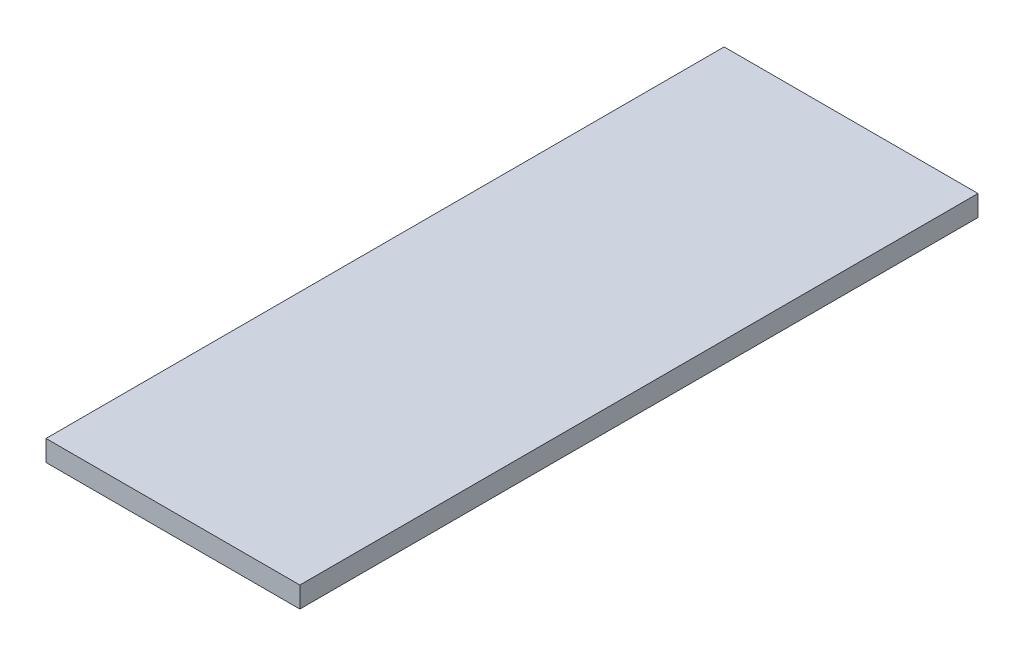
ISO-10303-21;
HEADER;
FILE_DESCRIPTION(('STEP AP214'),'2;1');
FILE_NAME('part.step','',(''),(''),'','','');
FILE_SCHEMA(('AUTOMOTIVE_DESIGN { 1 0 10303 214 1 1 1 1 }'));
ENDSEC;
DATA;
#1=APPLICATION_CONTEXT('core data for automotive mechanical design processes');
#2=APPLICATION_PROTOCOL_DEFINITION('international standard','automotive_design',2000,#1);
#3=PRODUCT_CONTEXT('',#1,'mechanical');
#4=PRODUCT('Part','Part','',(#3));
#5=PRODUCT_RELATED_PRODUCT_CATEGORY('part','',(#4));
#6=PRODUCT_DEFINITION_FORMATION('','',#4);
#7=PRODUCT_DEFINITION_CONTEXT('part definition',#1,'design');
#8=PRODUCT_DEFINITION('design','',#6,#7);
#9=PRODUCT_DEFINITION_SHAPE('','',#8);
#10=(LENGTH_UNIT() NAMED_UNIT(*) SI_UNIT(.MILLI.,.METRE.));
#11=(NAMED_UNIT(*) PLANE_ANGLE_UNIT() SI_UNIT($,.RADIAN.));
#12=(NAMED_UNIT(*) SI_UNIT($,.STERADIAN.) SOLID_ANGLE_UNIT());
#13=UNCERTAINTY_MEASURE_WITH_UNIT(LENGTH_MEASURE(1.E-05),#10,'distance_accuracy_value','');
#14=(GEOMETRIC_REPRESENTATION_CONTEXT(3) GLOBAL_UNCERTAINTY_ASSIGNED_CONTEXT((#13)) GLOBAL_UNIT_ASSIGNED_CONTEXT((#10,
#11,#12)) REPRESENTATION_CONTEXT('',''));
#15=CARTESIAN_POINT('',(0.,0.,0.));
#16=DIRECTION('',(0.,0.,1.));
#17=DIRECTION('',(1.,0.,0.));
#18=AXIS2_PLACEMENT_3D('',#15,#16,#17);
#19=CARTESIAN_POINT('',(19.325,3.175,64.3249999999999));
#20=DIRECTION('',(-1.,0.,0.));
#21=DIRECTION('',(0.,0.,1.));
#22=AXIS2_PLACEMENT_3D('',#19,#20,#21);
#23=PLANE('',#22);
#24=DIRECTION('',(0.,0.,-1.));
#25=VECTOR('',#24,1.);
#26=CARTESIAN_POINT('',(19.325,0.,64.3249999999999));
#27=LINE('',#26,#25);
#28=CARTESIAN_POINT('',(19.325,0.,64.3249999999999));
#29=VERTEX_POINT('',#28);
#30=CARTESIAN_POINT('',(19.325,0.,-38.925));
#31=VERTEX_POINT('',#30);
#32=EDGE_CURVE('E81',#29,#31,#27,.T.);
#33=ORIENTED_EDGE('',*,*,#32,.T.);
#34=DIRECTION('',(0.,1.,0.));
#35=VECTOR('',#34,1.);
#36=CARTESIAN_POINT('',(19.325,0.,-38.925));
#37=LINE('',#36,#35);
#38=CARTESIAN_POINT('',(19.325,3.175,-38.925));
#39=VERTEX_POINT('',#38);
#40=EDGE_CURVE('E47',#31,#39,#37,.T.);
#41=ORIENTED_EDGE('',*,*,#40,.T.);
#42=DIRECTION('',(0.,0.,-1.));
#43=VECTOR('',#42,1.);
#44=CARTESIAN_POINT('',(19.325,3.175,64.3249999999999));
#45=LINE('',#44,#43);
#46=CARTESIAN_POINT('',(19.325,3.175,64.3249999999999));
#47=VERTEX_POINT('',#46);
#48=EDGE_CURVE('E76',#47,#39,#45,.T.);
#49=ORIENTED_EDGE('',*,*,#48,.F.);
#50=DIRECTION('',(0.,-1.,0.));
#51=VECTOR('',#50,1.);
#52=CARTESIAN_POINT('',(19.325,3.175,64.3249999999999));
#53=LINE('',#52,#51);
#54=EDGE_CURVE('E40',#47,#29,#53,.T.);
#55=ORIENTED_EDGE('',*,*,#54,.T.);
#56=EDGE_LOOP('',(#33,#41,#49,#55));
#57=FACE_BOUND('',#56,.T.);
#58=ADVANCED_FACE('F33',(#57),#23,.F.);
#59=CARTESIAN_POINT('',(-19.325,3.175,64.3249999999999));
#60=DIRECTION('',(1.,0.,0.));
#61=DIRECTION('',(0.,0.,-1.));
#62=AXIS2_PLACEMENT_3D('',#59,#60,#61);
#63=PLANE('',#62);
#64=DIRECTION('',(0.,0.,1.));
#65=VECTOR('',#64,1.);
#66=CARTESIAN_POINT('',(-19.325,3.175,64.3249999999999));
#67=LINE('',#66,#65);
#68=CARTESIAN_POINT('',(-19.325,3.175,-38.925));
#69=VERTEX_POINT('',#68);
#70=CARTESIAN_POINT('',(-19.325,3.175,64.3249999999999));
#71=VERTEX_POINT('',#70);
#72=EDGE_CURVE('E90',#69,#71,#67,.T.);
#73=ORIENTED_EDGE('',*,*,#72,.F.);
#74=DIRECTION('',(0.,1.,0.));
#75=VECTOR('',#74,1.);
#76=CARTESIAN_POINT('',(-19.325,0.,-38.925));
#77=LINE('',#76,#75);
#78=CARTESIAN_POINT('',(-19.325,0.,-38.925));
#79=VERTEX_POINT('',#78);
#80=EDGE_CURVE('E86',#79,#69,#77,.T.);
#81=ORIENTED_EDGE('',*,*,#80,.F.);
#82=DIRECTION('',(0.,0.,1.));
#83=VECTOR('',#82,1.);
#84=CARTESIAN_POINT('',(-19.325,0.,64.3249999999999));
#85=LINE('',#84,#83);
#86=CARTESIAN_POINT('',(-19.325,0.,64.3249999999999));
#87=VERTEX_POINT('',#86);
#88=EDGE_CURVE('E77',#79,#87,#85,.T.);
#89=ORIENTED_EDGE('',*,*,#88,.T.);
#90=DIRECTION('',(0.,-1.,0.));
#91=VECTOR('',#90,1.);
#92=CARTESIAN_POINT('',(-19.325,3.175,64.3249999999999));
#93=LINE('',#92,#91);
#94=EDGE_CURVE('E11',#71,#87,#93,.T.);
#95=ORIENTED_EDGE('',*,*,#94,.F.);
#96=EDGE_LOOP('',(#73,#81,#89,#95));
#97=FACE_BOUND('',#96,.T.);
#98=ADVANCED_FACE('F111',(#97),#63,.F.);
#99=CARTESIAN_POINT('',(-19.325,3.175,64.3249999999999));
#100=DIRECTION('',(0.,0.,-1.));
#101=DIRECTION('',(-1.,0.,0.));
#102=AXIS2_PLACEMENT_3D('',#99,#100,#101);
#103=PLANE('',#102);
#104=DIRECTION('',(1.,0.,0.));
#105=VECTOR('',#104,1.);
#106=CARTESIAN_POINT('',(-19.325,0.,64.3249999999999));
#107=LINE('',#106,#105);
#108=EDGE_CURVE('E68',#87,#29,#107,.T.);
#109=ORIENTED_EDGE('',*,*,#108,.T.);
#110=ORIENTED_EDGE('',*,*,#54,.F.);
#111=DIRECTION('',(1.,0.,0.));
#112=VECTOR('',#111,1.);
#113=CARTESIAN_POINT('',(-19.325,3.175,64.3249999999999));
#114=LINE('',#113,#112);
#115=EDGE_CURVE('E56',#71,#47,#114,.T.);
#116=ORIENTED_EDGE('',*,*,#115,.F.);
#117=ORIENTED_EDGE('',*,*,#94,.T.);
#118=EDGE_LOOP('',(#109,#110,#116,#117));
#119=FACE_BOUND('',#118,.T.);
#120=ADVANCED_FACE('F70',(#119),#103,.F.);
#121=CARTESIAN_POINT('',(0.,3.175,0.));
#122=DIRECTION('',(0.,-1.,0.));
#123=DIRECTION('',(0.,0.,-1.));
#124=AXIS2_PLACEMENT_3D('',#121,#122,#123);
#125=PLANE('',#124);
#126=ORIENTED_EDGE('',*,*,#48,.T.);
#127=DIRECTION('',(1.,0.,0.));
#128=VECTOR('',#127,1.);
#129=CARTESIAN_POINT('',(-19.325,3.175,-38.925));
#130=LINE('',#129,#128);
#131=EDGE_CURVE('E95',#69,#39,#130,.T.);
#132=ORIENTED_EDGE('',*,*,#131,.F.);
#133=ORIENTED_EDGE('',*,*,#72,.T.);
#134=ORIENTED_EDGE('',*,*,#115,.T.);
#135=EDGE_LOOP('',(#126,#132,#133,#134));
#136=FACE_BOUND('',#135,.T.);
#137=ADVANCED_FACE('F103',(#136),#125,.F.);
#138=CARTESIAN_POINT('',(0.,0.,0.));
#139=DIRECTION('',(0.,-1.,0.));
#140=DIRECTION('',(0.,0.,-1.));
#141=AXIS2_PLACEMENT_3D('',#138,#139,#140);
#142=PLANE('',#141);
#143=DIRECTION('',(1.,0.,0.));
#144=VECTOR('',#143,1.);
#145=CARTESIAN_POINT('',(-19.325,0.,-38.925));
#146=LINE('',#145,#144);
#147=EDGE_CURVE('E83',#79,#31,#146,.T.);
#148=ORIENTED_EDGE('',*,*,#147,.T.);
#149=ORIENTED_EDGE('',*,*,#32,.F.);
#150=ORIENTED_EDGE('',*,*,#108,.F.);
#151=ORIENTED_EDGE('',*,*,#88,.F.);
#152=EDGE_LOOP('',(#148,#149,#150,#151));
#153=FACE_BOUND('',#152,.T.);
#154=ADVANCED_FACE('F82',(#153),#142,.T.);
#155=CARTESIAN_POINT('',(-19.325,0.,-38.925));
#156=DIRECTION('',(0.,0.,1.));
#157=DIRECTION('',(1.,0.,0.));
#158=AXIS2_PLACEMENT_3D('',#155,#156,#157);
#159=PLANE('',#158);
#160=ORIENTED_EDGE('',*,*,#131,.T.);
#161=ORIENTED_EDGE('',*,*,#40,.F.);
#162=ORIENTED_EDGE('',*,*,#147,.F.);
#163=ORIENTED_EDGE('',*,*,#80,.T.);
#164=EDGE_LOOP('',(#160,#161,#162,#163));
#165=FACE_BOUND('',#164,.T.);
#166=ADVANCED_FACE('F99',(#165),#159,.F.);
#167=CLOSED_SHELL('',(#58,#98,#120,#137,#154,#166));
#168=MANIFOLD_SOLID_BREP('B2',#167);
#169=ADVANCED_BREP_SHAPE_REPRESENTATION('',(#18,#168),#14);
#170=SHAPE_DEFINITION_REPRESENTATION(#9,#169);
ENDSEC;
END-ISO-10303-21;
